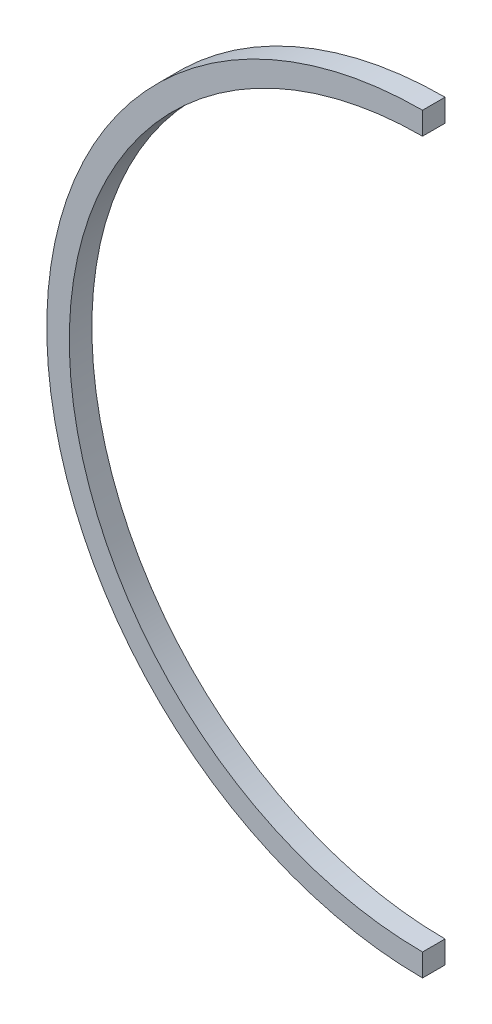
ISO-10303-21;
HEADER;
FILE_DESCRIPTION(('STEP AP214'),'2;1');
FILE_NAME('part.step','',(''),(''),'','','');
FILE_SCHEMA(('AUTOMOTIVE_DESIGN { 1 0 10303 214 1 1 1 1 }'));
ENDSEC;
DATA;
#1=APPLICATION_CONTEXT('core data for automotive mechanical design processes');
#2=APPLICATION_PROTOCOL_DEFINITION('international standard','automotive_design',2000,#1);
#3=PRODUCT_CONTEXT('',#1,'mechanical');
#4=PRODUCT('Part','Part','',(#3));
#5=PRODUCT_RELATED_PRODUCT_CATEGORY('part','',(#4));
#6=PRODUCT_DEFINITION_FORMATION('','',#4);
#7=PRODUCT_DEFINITION_CONTEXT('part definition',#1,'design');
#8=PRODUCT_DEFINITION('design','',#6,#7);
#9=PRODUCT_DEFINITION_SHAPE('','',#8);
#10=(LENGTH_UNIT() NAMED_UNIT(*) SI_UNIT(.MILLI.,.METRE.));
#11=(NAMED_UNIT(*) PLANE_ANGLE_UNIT() SI_UNIT($,.RADIAN.));
#12=(NAMED_UNIT(*) SI_UNIT($,.STERADIAN.) SOLID_ANGLE_UNIT());
#13=UNCERTAINTY_MEASURE_WITH_UNIT(LENGTH_MEASURE(1.E-05),#10,'distance_accuracy_value','');
#14=(GEOMETRIC_REPRESENTATION_CONTEXT(3) GLOBAL_UNCERTAINTY_ASSIGNED_CONTEXT((#13)) GLOBAL_UNIT_ASSIGNED_CONTEXT((#10,
#11,#12)) REPRESENTATION_CONTEXT('',''));
#15=CARTESIAN_POINT('',(0.,0.,0.));
#16=DIRECTION('',(0.,0.,1.));
#17=DIRECTION('',(1.,0.,0.));
#18=AXIS2_PLACEMENT_3D('',#15,#16,#17);
#19=CARTESIAN_POINT('',(-300.,0.,0.));
#20=DIRECTION('',(-1.,0.,0.));
#21=DIRECTION('',(0.,0.,1.));
#22=AXIS2_PLACEMENT_3D('',#19,#20,#21);
#23=PLANE('',#22);
#24=DIRECTION('',(0.,1.,0.));
#25=VECTOR('',#24,1.);
#26=CARTESIAN_POINT('',(-300.,0.,3.));
#27=LINE('',#26,#25);
#28=CARTESIAN_POINT('',(-300.,-50.,3.));
#29=VERTEX_POINT('',#28);
#30=CARTESIAN_POINT('',(-300.,-47.,3.));
#31=VERTEX_POINT('',#30);
#32=EDGE_CURVE('E78',#29,#31,#27,.T.);
#33=ORIENTED_EDGE('',*,*,#32,.F.);
#34=DIRECTION('',(0.,0.,-1.));
#35=VECTOR('',#34,1.);
#36=CARTESIAN_POINT('',(-300.,-50.,60.));
#37=LINE('',#36,#35);
#38=CARTESIAN_POINT('',(-300.,-50.,0.));
#39=VERTEX_POINT('',#38);
#40=EDGE_CURVE('E40',#29,#39,#37,.T.);
#41=ORIENTED_EDGE('',*,*,#40,.T.);
#42=DIRECTION('',(0.,-1.,0.));
#43=VECTOR('',#42,1.);
#44=CARTESIAN_POINT('',(-300.,0.,0.));
#45=LINE('',#44,#43);
#46=CARTESIAN_POINT('',(-300.,-47.,0.));
#47=VERTEX_POINT('',#46);
#48=EDGE_CURVE('E95',#47,#39,#45,.T.);
#49=ORIENTED_EDGE('',*,*,#48,.F.);
#50=DIRECTION('',(0.,0.,1.));
#51=VECTOR('',#50,1.);
#52=CARTESIAN_POINT('',(-300.,-47.,3.));
#53=LINE('',#52,#51);
#54=EDGE_CURVE('E11',#47,#31,#53,.T.);
#55=ORIENTED_EDGE('',*,*,#54,.T.);
#56=EDGE_LOOP('',(#33,#41,#49,#55));
#57=FACE_BOUND('',#56,.T.);
#58=ADVANCED_FACE('F32',(#57),#23,.F.);
#59=CARTESIAN_POINT('',(0.,0.,3.));
#60=DIRECTION('',(0.,0.,1.));
#61=DIRECTION('',(1.,0.,0.));
#62=AXIS2_PLACEMENT_3D('',#59,#60,#61);
#63=PLANE('',#62);
#64=ORIENTED_EDGE('',*,*,#32,.T.);
#65=CARTESIAN_POINT('',(-300.,0.,3.));
#66=DIRECTION('',(0.,0.,1.));
#67=DIRECTION('',(1.,0.,0.));
#68=AXIS2_PLACEMENT_3D('',#65,#66,#67);
#69=CIRCLE('',#68,47.);
#70=CARTESIAN_POINT('',(-300.,47.,3.));
#71=VERTEX_POINT('',#70);
#72=EDGE_CURVE('E82',#31,#71,#69,.F.);
#73=ORIENTED_EDGE('',*,*,#72,.T.);
#74=DIRECTION('',(0.,1.,0.));
#75=VECTOR('',#74,1.);
#76=CARTESIAN_POINT('',(-300.,0.,3.));
#77=LINE('',#76,#75);
#78=CARTESIAN_POINT('',(-300.,50.,3.));
#79=VERTEX_POINT('',#78);
#80=EDGE_CURVE('E81',#71,#79,#77,.T.);
#81=ORIENTED_EDGE('',*,*,#80,.T.);
#82=CARTESIAN_POINT('',(-300.,0.,3.));
#83=DIRECTION('',(0.,0.,1.));
#84=DIRECTION('',(1.,0.,0.));
#85=AXIS2_PLACEMENT_3D('',#82,#83,#84);
#86=CIRCLE('',#85,50.);
#87=EDGE_CURVE('E73',#79,#29,#86,.T.);
#88=ORIENTED_EDGE('',*,*,#87,.T.);
#89=EDGE_LOOP('',(#64,#73,#81,#88));
#90=FACE_BOUND('',#89,.T.);
#91=ADVANCED_FACE('F85',(#90),#63,.T.);
#92=CARTESIAN_POINT('',(-300.,0.,3.));
#93=DIRECTION('',(0.,0.,1.));
#94=DIRECTION('',(1.,0.,0.));
#95=AXIS2_PLACEMENT_3D('',#92,#93,#94);
#96=CYLINDRICAL_SURFACE('',#95,47.);
#97=ORIENTED_EDGE('',*,*,#72,.F.);
#98=ORIENTED_EDGE('',*,*,#54,.F.);
#99=CARTESIAN_POINT('',(-300.,0.,0.));
#100=DIRECTION('',(0.,0.,-1.));
#101=DIRECTION('',(-1.,0.,0.));
#102=AXIS2_PLACEMENT_3D('',#99,#100,#101);
#103=CIRCLE('',#102,47.);
#104=CARTESIAN_POINT('',(-300.,47.,0.));
#105=VERTEX_POINT('',#104);
#106=EDGE_CURVE('E93',#47,#105,#103,.T.);
#107=ORIENTED_EDGE('',*,*,#106,.T.);
#108=DIRECTION('',(0.,0.,1.));
#109=VECTOR('',#108,1.);
#110=CARTESIAN_POINT('',(-300.,47.,3.));
#111=LINE('',#110,#109);
#112=EDGE_CURVE('E90',#105,#71,#111,.T.);
#113=ORIENTED_EDGE('',*,*,#112,.T.);
#114=EDGE_LOOP('',(#97,#98,#107,#113));
#115=FACE_BOUND('',#114,.T.);
#116=ADVANCED_FACE('F34',(#115),#96,.F.);
#117=CARTESIAN_POINT('',(-300.,0.,60.));
#118=DIRECTION('',(0.,0.,-1.));
#119=DIRECTION('',(-1.,0.,0.));
#120=AXIS2_PLACEMENT_3D('',#117,#118,#119);
#121=CYLINDRICAL_SURFACE('',#120,50.);
#122=ORIENTED_EDGE('',*,*,#87,.F.);
#123=DIRECTION('',(0.,0.,-1.));
#124=VECTOR('',#123,1.);
#125=CARTESIAN_POINT('',(-300.,50.,60.));
#126=LINE('',#125,#124);
#127=CARTESIAN_POINT('',(-300.,50.,0.));
#128=VERTEX_POINT('',#127);
#129=EDGE_CURVE('E92',#79,#128,#126,.T.);
#130=ORIENTED_EDGE('',*,*,#129,.T.);
#131=CARTESIAN_POINT('',(-300.,0.,0.));
#132=DIRECTION('',(0.,0.,1.));
#133=DIRECTION('',(1.,0.,0.));
#134=AXIS2_PLACEMENT_3D('',#131,#132,#133);
#135=CIRCLE('',#134,50.);
#136=EDGE_CURVE('E75',#128,#39,#135,.T.);
#137=ORIENTED_EDGE('',*,*,#136,.T.);
#138=ORIENTED_EDGE('',*,*,#40,.F.);
#139=EDGE_LOOP('',(#122,#130,#137,#138));
#140=FACE_BOUND('',#139,.T.);
#141=ADVANCED_FACE('F71',(#140),#121,.T.);
#142=CARTESIAN_POINT('',(-300.,0.,0.));
#143=DIRECTION('',(0.,0.,1.));
#144=DIRECTION('',(1.,0.,0.));
#145=AXIS2_PLACEMENT_3D('',#142,#143,#144);
#146=PLANE('',#145);
#147=ORIENTED_EDGE('',*,*,#136,.F.);
#148=EDGE_CURVE('E76',#128,#105,#45,.T.);
#149=ORIENTED_EDGE('',*,*,#148,.T.);
#150=ORIENTED_EDGE('',*,*,#106,.F.);
#151=ORIENTED_EDGE('',*,*,#48,.T.);
#152=EDGE_LOOP('',(#147,#149,#150,#151));
#153=FACE_BOUND('',#152,.T.);
#154=ADVANCED_FACE('F103',(#153),#146,.F.);
#155=ORIENTED_EDGE('',*,*,#80,.F.);
#156=ORIENTED_EDGE('',*,*,#112,.F.);
#157=ORIENTED_EDGE('',*,*,#148,.F.);
#158=ORIENTED_EDGE('',*,*,#129,.F.);
#159=EDGE_LOOP('',(#155,#156,#157,#158));
#160=FACE_BOUND('',#159,.T.);
#161=ADVANCED_FACE('F105',(#160),#23,.F.);
#162=CLOSED_SHELL('',(#58,#91,#116,#141,#154,#161));
#163=MANIFOLD_SOLID_BREP('B2',#162);
#164=ADVANCED_BREP_SHAPE_REPRESENTATION('',(#18,#163),#14);
#165=SHAPE_DEFINITION_REPRESENTATION(#9,#164);
ENDSEC;
END-ISO-10303-21;
